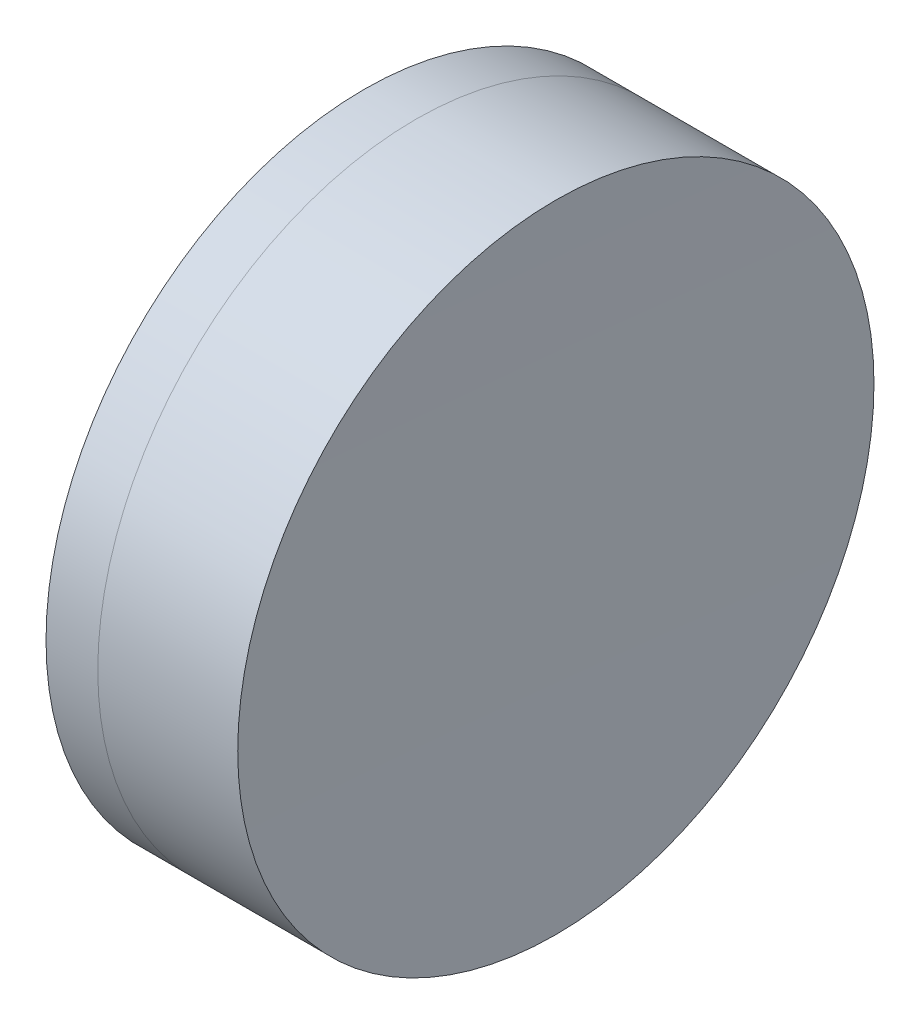
ISO-10303-21;
HEADER;
FILE_DESCRIPTION(('STEP AP214'),'2;1');
FILE_NAME('part.step','',(''),(''),'','','');
FILE_SCHEMA(('AUTOMOTIVE_DESIGN { 1 0 10303 214 1 1 1 1 }'));
ENDSEC;
DATA;
#1=APPLICATION_CONTEXT('core data for automotive mechanical design processes');
#2=APPLICATION_PROTOCOL_DEFINITION('international standard','automotive_design',2000,#1);
#3=PRODUCT_CONTEXT('',#1,'mechanical');
#4=PRODUCT('Part','Part','',(#3));
#5=PRODUCT_RELATED_PRODUCT_CATEGORY('part','',(#4));
#6=PRODUCT_DEFINITION_FORMATION('','',#4);
#7=PRODUCT_DEFINITION_CONTEXT('part definition',#1,'design');
#8=PRODUCT_DEFINITION('design','',#6,#7);
#9=PRODUCT_DEFINITION_SHAPE('','',#8);
#10=(LENGTH_UNIT() NAMED_UNIT(*) SI_UNIT(.MILLI.,.METRE.));
#11=(NAMED_UNIT(*) PLANE_ANGLE_UNIT() SI_UNIT($,.RADIAN.));
#12=(NAMED_UNIT(*) SI_UNIT($,.STERADIAN.) SOLID_ANGLE_UNIT());
#13=UNCERTAINTY_MEASURE_WITH_UNIT(LENGTH_MEASURE(1.E-05),#10,'distance_accuracy_value','');
#14=(GEOMETRIC_REPRESENTATION_CONTEXT(3) GLOBAL_UNCERTAINTY_ASSIGNED_CONTEXT((#13)) GLOBAL_UNIT_ASSIGNED_CONTEXT((#10,
#11,#12)) REPRESENTATION_CONTEXT('',''));
#15=CARTESIAN_POINT('',(0.,0.,0.));
#16=DIRECTION('',(0.,0.,1.));
#17=DIRECTION('',(1.,0.,0.));
#18=AXIS2_PLACEMENT_3D('',#15,#16,#17);
#19=CARTESIAN_POINT('',(16.8040362142955,0.,0.));
#20=DIRECTION('',(-1.,0.,0.));
#21=DIRECTION('',(0.,0.,-1.));
#22=AXIS2_PLACEMENT_3D('',#19,#20,#21);
#23=SPHERICAL_SURFACE('',#22,23.66);
#24=CARTESIAN_POINT('',(36.7666412547204,0.,0.));
#25=DIRECTION('',(-1.,0.,0.));
#26=DIRECTION('',(0.,0.,1.));
#27=AXIS2_PLACEMENT_3D('',#24,#25,#26);
#28=CIRCLE('',#27,12.7);
#29=CARTESIAN_POINT('',(36.7666412547204,0.,12.7));
#30=VERTEX_POINT('',#29);
#31=EDGE_CURVE('E51',#30,#30,#28,.T.);
#32=ORIENTED_EDGE('',*,*,#31,.T.);
#33=EDGE_LOOP('',(#32));
#34=FACE_BOUND('',#33,.T.);
#35=ADVANCED_FACE('F45',(#34),#23,.F.);
#36=CARTESIAN_POINT('',(942.264036214295,0.,0.));
#37=DIRECTION('',(-1.,0.,0.));
#38=DIRECTION('',(0.,0.,-1.));
#39=AXIS2_PLACEMENT_3D('',#36,#37,#38);
#40=SPHERICAL_SURFACE('',#39,900.);
#41=CARTESIAN_POINT('',(42.3536462309371,0.,0.));
#42=DIRECTION('',(-1.,0.,0.));
#43=DIRECTION('',(0.,0.,1.));
#44=AXIS2_PLACEMENT_3D('',#41,#42,#43);
#45=CIRCLE('',#44,12.7);
#46=CARTESIAN_POINT('',(42.3536462309371,0.,12.7));
#47=VERTEX_POINT('',#46);
#48=EDGE_CURVE('E11',#47,#47,#45,.T.);
#49=ORIENTED_EDGE('',*,*,#48,.F.);
#50=EDGE_LOOP('',(#49));
#51=FACE_BOUND('',#50,.T.);
#52=ADVANCED_FACE('F60',(#51),#40,.F.);
#53=CARTESIAN_POINT('',(-0.551919992657797,0.,0.));
#54=DIRECTION('',(-1.,0.,0.));
#55=DIRECTION('',(0.,0.,1.));
#56=AXIS2_PLACEMENT_3D('',#53,#54,#55);
#57=CYLINDRICAL_SURFACE('',#56,12.7);
#58=ORIENTED_EDGE('',*,*,#48,.T.);
#59=EDGE_LOOP('',(#58));
#60=FACE_BOUND('',#59,.T.);
#61=ORIENTED_EDGE('',*,*,#31,.F.);
#62=EDGE_LOOP('',(#61));
#63=FACE_BOUND('',#62,.T.);
#64=ADVANCED_FACE('F58',(#60,#63),#57,.T.);
#65=CLOSED_SHELL('',(#35,#52,#64));
#66=MANIFOLD_SOLID_BREP('B2',#65);
#67=CARTESIAN_POINT('',(53.8040362142955,0.,0.));
#68=DIRECTION('',(-1.,0.,0.));
#69=DIRECTION('',(0.,0.,1.));
#70=AXIS2_PLACEMENT_3D('',#67,#68,#69);
#71=SPHERICAL_SURFACE('',#70,22.94);
#72=CARTESIAN_POINT('',(34.7002774218483,0.,0.));
#73=DIRECTION('',(-1.,0.,0.));
#74=DIRECTION('',(0.,0.,1.));
#75=AXIS2_PLACEMENT_3D('',#72,#73,#74);
#76=CIRCLE('',#75,12.7);
#77=CARTESIAN_POINT('',(34.7002774218483,0.,12.7));
#78=VERTEX_POINT('',#77);
#79=EDGE_CURVE('E44',#78,#78,#76,.T.);
#80=ORIENTED_EDGE('',*,*,#79,.T.);
#81=EDGE_LOOP('',(#80));
#82=FACE_BOUND('',#81,.T.);
#83=ADVANCED_FACE('F86',(#82),#71,.T.);
#84=CARTESIAN_POINT('',(-0.816062176165804,0.,0.));
#85=DIRECTION('',(-1.,0.,0.));
#86=DIRECTION('',(0.,0.,1.));
#87=AXIS2_PLACEMENT_3D('',#84,#85,#86);
#88=CYLINDRICAL_SURFACE('',#87,12.7);
#89=CARTESIAN_POINT('',(36.7666412547204,0.,0.));
#90=DIRECTION('',(-1.,0.,0.));
#91=DIRECTION('',(0.,0.,1.));
#92=AXIS2_PLACEMENT_3D('',#89,#90,#91);
#93=CIRCLE('',#92,12.7);
#94=CARTESIAN_POINT('',(36.7666412547204,0.,12.7));
#95=VERTEX_POINT('',#94);
#96=EDGE_CURVE('E92',#95,#95,#93,.T.);
#97=ORIENTED_EDGE('',*,*,#96,.T.);
#98=EDGE_LOOP('',(#97));
#99=FACE_BOUND('',#98,.T.);
#100=ORIENTED_EDGE('',*,*,#79,.F.);
#101=EDGE_LOOP('',(#100));
#102=FACE_BOUND('',#101,.T.);
#103=ADVANCED_FACE('F98',(#99,#102),#88,.T.);
#104=CARTESIAN_POINT('',(16.8040362142955,0.,0.));
#105=DIRECTION('',(-1.,0.,0.));
#106=DIRECTION('',(0.,0.,1.));
#107=AXIS2_PLACEMENT_3D('',#104,#105,#106);
#108=SPHERICAL_SURFACE('',#107,23.66);
#109=ORIENTED_EDGE('',*,*,#96,.F.);
#110=EDGE_LOOP('',(#109));
#111=FACE_BOUND('',#110,.T.);
#112=ADVANCED_FACE('F101',(#111),#108,.T.);
#113=CLOSED_SHELL('',(#83,#103,#112));
#114=MANIFOLD_SOLID_BREP('B6',#113);
#115=ADVANCED_BREP_SHAPE_REPRESENTATION('',(#18,#66,#114),#14);
#116=SHAPE_DEFINITION_REPRESENTATION(#9,#115);
ENDSEC;
END-ISO-10303-21;
